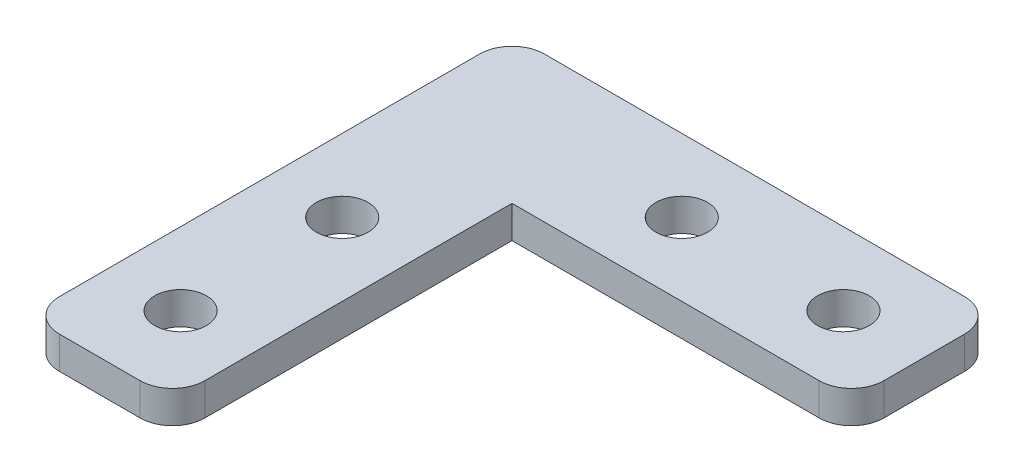
ISO-10303-21;
HEADER;
FILE_DESCRIPTION(('STEP AP214'),'2;1');
FILE_NAME('part.step','',(''),(''),'','','');
FILE_SCHEMA(('AUTOMOTIVE_DESIGN { 1 0 10303 214 1 1 1 1 }'));
ENDSEC;
DATA;
#1=APPLICATION_CONTEXT('core data for automotive mechanical design processes');
#2=APPLICATION_PROTOCOL_DEFINITION('international standard','automotive_design',2000,#1);
#3=PRODUCT_CONTEXT('',#1,'mechanical');
#4=PRODUCT('Part','Part','',(#3));
#5=PRODUCT_RELATED_PRODUCT_CATEGORY('part','',(#4));
#6=PRODUCT_DEFINITION_FORMATION('','',#4);
#7=PRODUCT_DEFINITION_CONTEXT('part definition',#1,'design');
#8=PRODUCT_DEFINITION('design','',#6,#7);
#9=PRODUCT_DEFINITION_SHAPE('','',#8);
#10=(LENGTH_UNIT() NAMED_UNIT(*) SI_UNIT(.MILLI.,.METRE.));
#11=(NAMED_UNIT(*) PLANE_ANGLE_UNIT() SI_UNIT($,.RADIAN.));
#12=(NAMED_UNIT(*) SI_UNIT($,.STERADIAN.) SOLID_ANGLE_UNIT());
#13=UNCERTAINTY_MEASURE_WITH_UNIT(LENGTH_MEASURE(1.E-05),#10,'distance_accuracy_value','');
#14=(GEOMETRIC_REPRESENTATION_CONTEXT(3) GLOBAL_UNCERTAINTY_ASSIGNED_CONTEXT((#13)) GLOBAL_UNIT_ASSIGNED_CONTEXT((#10,
#11,#12)) REPRESENTATION_CONTEXT('',''));
#15=CARTESIAN_POINT('',(0.,0.,0.));
#16=DIRECTION('',(0.,0.,1.));
#17=DIRECTION('',(1.,0.,0.));
#18=AXIS2_PLACEMENT_3D('',#15,#16,#17);
#19=CARTESIAN_POINT('',(0.,2.,0.));
#20=DIRECTION('',(0.,-1.,0.));
#21=DIRECTION('',(0.,0.,-1.));
#22=AXIS2_PLACEMENT_3D('',#19,#20,#21);
#23=PLANE('',#22);
#24=DIRECTION('',(-1.,0.,0.));
#25=VECTOR('',#24,1.);
#26=CARTESIAN_POINT('',(-15.,2.,-15.));
#27=LINE('',#26,#25);
#28=CARTESIAN_POINT('',(13.,2.,-15.));
#29=VERTEX_POINT('',#28);
#30=CARTESIAN_POINT('',(-13.,2.,-15.));
#31=VERTEX_POINT('',#30);
#32=EDGE_CURVE('E128',#29,#31,#27,.T.);
#33=ORIENTED_EDGE('',*,*,#32,.T.);
#34=CARTESIAN_POINT('',(-13.,2.,-13.));
#35=DIRECTION('',(0.,-1.,0.));
#36=DIRECTION('',(0.,0.,-1.));
#37=AXIS2_PLACEMENT_3D('',#34,#35,#36);
#38=CIRCLE('',#37,2.);
#39=CARTESIAN_POINT('',(-15.,2.,-13.));
#40=VERTEX_POINT('',#39);
#41=EDGE_CURVE('E175',#31,#40,#38,.F.);
#42=ORIENTED_EDGE('',*,*,#41,.T.);
#43=DIRECTION('',(0.,0.,1.));
#44=VECTOR('',#43,1.);
#45=CARTESIAN_POINT('',(-15.,2.,15.));
#46=LINE('',#45,#44);
#47=CARTESIAN_POINT('',(-15.,2.,13.));
#48=VERTEX_POINT('',#47);
#49=EDGE_CURVE('E121',#40,#48,#46,.T.);
#50=ORIENTED_EDGE('',*,*,#49,.T.);
#51=CARTESIAN_POINT('',(-13.,2.,13.));
#52=DIRECTION('',(0.,-1.,0.));
#53=DIRECTION('',(0.,0.,-1.));
#54=AXIS2_PLACEMENT_3D('',#51,#52,#53);
#55=CIRCLE('',#54,2.);
#56=CARTESIAN_POINT('',(-13.,2.,15.));
#57=VERTEX_POINT('',#56);
#58=EDGE_CURVE('E169',#48,#57,#55,.F.);
#59=ORIENTED_EDGE('',*,*,#58,.T.);
#60=DIRECTION('',(1.,0.,0.));
#61=VECTOR('',#60,1.);
#62=CARTESIAN_POINT('',(-6.,2.,15.));
#63=LINE('',#62,#61);
#64=CARTESIAN_POINT('',(-8.,2.,15.));
#65=VERTEX_POINT('',#64);
#66=EDGE_CURVE('E110',#57,#65,#63,.T.);
#67=ORIENTED_EDGE('',*,*,#66,.T.);
#68=CARTESIAN_POINT('',(-8.,2.,13.));
#69=DIRECTION('',(0.,-1.,0.));
#70=DIRECTION('',(0.,0.,-1.));
#71=AXIS2_PLACEMENT_3D('',#68,#69,#70);
#72=CIRCLE('',#71,2.);
#73=CARTESIAN_POINT('',(-6.,2.,13.));
#74=VERTEX_POINT('',#73);
#75=EDGE_CURVE('E106',#65,#74,#72,.F.);
#76=ORIENTED_EDGE('',*,*,#75,.T.);
#77=DIRECTION('',(0.,0.,-1.));
#78=VECTOR('',#77,1.);
#79=CARTESIAN_POINT('',(-6.,2.,-6.));
#80=LINE('',#79,#78);
#81=CARTESIAN_POINT('',(-6.,2.,-6.));
#82=VERTEX_POINT('',#81);
#83=EDGE_CURVE('E98',#74,#82,#80,.T.);
#84=ORIENTED_EDGE('',*,*,#83,.T.);
#85=DIRECTION('',(1.,0.,0.));
#86=VECTOR('',#85,1.);
#87=CARTESIAN_POINT('',(15.,2.,-6.));
#88=LINE('',#87,#86);
#89=CARTESIAN_POINT('',(13.,2.,-6.));
#90=VERTEX_POINT('',#89);
#91=EDGE_CURVE('E103',#82,#90,#88,.T.);
#92=ORIENTED_EDGE('',*,*,#91,.T.);
#93=CARTESIAN_POINT('',(13.,2.,-8.));
#94=DIRECTION('',(0.,-1.,0.));
#95=DIRECTION('',(0.,0.,-1.));
#96=AXIS2_PLACEMENT_3D('',#93,#94,#95);
#97=CIRCLE('',#96,2.);
#98=CARTESIAN_POINT('',(15.,2.,-8.));
#99=VERTEX_POINT('',#98);
#100=EDGE_CURVE('E38',#90,#99,#97,.F.);
#101=ORIENTED_EDGE('',*,*,#100,.T.);
#102=DIRECTION('',(0.,0.,-1.));
#103=VECTOR('',#102,1.);
#104=CARTESIAN_POINT('',(15.,2.,-15.));
#105=LINE('',#104,#103);
#106=CARTESIAN_POINT('',(15.,2.,-13.));
#107=VERTEX_POINT('',#106);
#108=EDGE_CURVE('E126',#99,#107,#105,.T.);
#109=ORIENTED_EDGE('',*,*,#108,.T.);
#110=CARTESIAN_POINT('',(13.,2.,-13.));
#111=DIRECTION('',(0.,-1.,0.));
#112=DIRECTION('',(0.,0.,-1.));
#113=AXIS2_PLACEMENT_3D('',#110,#111,#112);
#114=CIRCLE('',#113,2.);
#115=EDGE_CURVE('E173',#107,#29,#114,.F.);
#116=ORIENTED_EDGE('',*,*,#115,.T.);
#117=EDGE_LOOP('',(#33,#42,#50,#59,#67,#76,#84,#92,#101,#109,#116));
#118=FACE_BOUND('',#117,.T.);
#119=CARTESIAN_POINT('',(-10.5,2.,10.));
#120=DIRECTION('',(0.,1.,0.));
#121=DIRECTION('',(0.,0.,1.));
#122=AXIS2_PLACEMENT_3D('',#119,#120,#121);
#123=CIRCLE('',#122,1.6);
#124=CARTESIAN_POINT('',(-10.5,2.,11.6));
#125=VERTEX_POINT('',#124);
#126=EDGE_CURVE('E138',#125,#125,#123,.T.);
#127=ORIENTED_EDGE('',*,*,#126,.F.);
#128=EDGE_LOOP('',(#127));
#129=FACE_BOUND('',#128,.T.);
#130=CARTESIAN_POINT('',(0.,2.,-10.5));
#131=DIRECTION('',(0.,1.,0.));
#132=DIRECTION('',(0.,0.,1.));
#133=AXIS2_PLACEMENT_3D('',#130,#131,#132);
#134=CIRCLE('',#133,1.6);
#135=CARTESIAN_POINT('',(0.,2.,-8.9));
#136=VERTEX_POINT('',#135);
#137=EDGE_CURVE('E202',#136,#136,#134,.T.);
#138=ORIENTED_EDGE('',*,*,#137,.F.);
#139=EDGE_LOOP('',(#138));
#140=FACE_BOUND('',#139,.T.);
#141=CARTESIAN_POINT('',(-10.5,2.,0.));
#142=DIRECTION('',(0.,1.,0.));
#143=DIRECTION('',(0.,0.,1.));
#144=AXIS2_PLACEMENT_3D('',#141,#142,#143);
#145=CIRCLE('',#144,1.6);
#146=CARTESIAN_POINT('',(-10.5,2.,1.6));
#147=VERTEX_POINT('',#146);
#148=EDGE_CURVE('E208',#147,#147,#145,.T.);
#149=ORIENTED_EDGE('',*,*,#148,.F.);
#150=EDGE_LOOP('',(#149));
#151=FACE_BOUND('',#150,.T.);
#152=CARTESIAN_POINT('',(10.,2.,-10.5));
#153=DIRECTION('',(0.,1.,0.));
#154=DIRECTION('',(0.,0.,1.));
#155=AXIS2_PLACEMENT_3D('',#152,#153,#154);
#156=CIRCLE('',#155,1.6);
#157=CARTESIAN_POINT('',(10.,2.,-8.9));
#158=VERTEX_POINT('',#157);
#159=EDGE_CURVE('E214',#158,#158,#156,.T.);
#160=ORIENTED_EDGE('',*,*,#159,.F.);
#161=EDGE_LOOP('',(#160));
#162=FACE_BOUND('',#161,.T.);
#163=ADVANCED_FACE('F16',(#118,#129,#140,#151,#162),#23,.F.);
#164=CARTESIAN_POINT('',(0.,0.,0.));
#165=DIRECTION('',(0.,-1.,0.));
#166=DIRECTION('',(0.,0.,-1.));
#167=AXIS2_PLACEMENT_3D('',#164,#165,#166);
#168=PLANE('',#167);
#169=CARTESIAN_POINT('',(-10.5,0.,0.));
#170=DIRECTION('',(0.,1.,0.));
#171=DIRECTION('',(0.,0.,1.));
#172=AXIS2_PLACEMENT_3D('',#169,#170,#171);
#173=CIRCLE('',#172,1.6);
#174=CARTESIAN_POINT('',(-10.5,0.,1.6));
#175=VERTEX_POINT('',#174);
#176=EDGE_CURVE('E211',#175,#175,#173,.T.);
#177=ORIENTED_EDGE('',*,*,#176,.T.);
#178=EDGE_LOOP('',(#177));
#179=FACE_BOUND('',#178,.T.);
#180=CARTESIAN_POINT('',(-10.5,0.,10.));
#181=DIRECTION('',(0.,1.,0.));
#182=DIRECTION('',(0.,0.,1.));
#183=AXIS2_PLACEMENT_3D('',#180,#181,#182);
#184=CIRCLE('',#183,1.6);
#185=CARTESIAN_POINT('',(-10.5,0.,11.6));
#186=VERTEX_POINT('',#185);
#187=EDGE_CURVE('E199',#186,#186,#184,.T.);
#188=ORIENTED_EDGE('',*,*,#187,.T.);
#189=EDGE_LOOP('',(#188));
#190=FACE_BOUND('',#189,.T.);
#191=DIRECTION('',(0.,0.,1.));
#192=VECTOR('',#191,1.);
#193=CARTESIAN_POINT('',(-15.,0.,15.));
#194=LINE('',#193,#192);
#195=CARTESIAN_POINT('',(-15.,0.,-13.));
#196=VERTEX_POINT('',#195);
#197=CARTESIAN_POINT('',(-15.,0.,13.));
#198=VERTEX_POINT('',#197);
#199=EDGE_CURVE('E147',#196,#198,#194,.T.);
#200=ORIENTED_EDGE('',*,*,#199,.F.);
#201=CARTESIAN_POINT('',(-13.,0.,-13.));
#202=DIRECTION('',(0.,-1.,0.));
#203=DIRECTION('',(0.,0.,-1.));
#204=AXIS2_PLACEMENT_3D('',#201,#202,#203);
#205=CIRCLE('',#204,2.);
#206=CARTESIAN_POINT('',(-13.,0.,-15.));
#207=VERTEX_POINT('',#206);
#208=EDGE_CURVE('E162',#196,#207,#205,.T.);
#209=ORIENTED_EDGE('',*,*,#208,.T.);
#210=DIRECTION('',(-1.,0.,0.));
#211=VECTOR('',#210,1.);
#212=CARTESIAN_POINT('',(-15.,0.,-15.));
#213=LINE('',#212,#211);
#214=CARTESIAN_POINT('',(13.,0.,-15.));
#215=VERTEX_POINT('',#214);
#216=EDGE_CURVE('E144',#215,#207,#213,.T.);
#217=ORIENTED_EDGE('',*,*,#216,.F.);
#218=CARTESIAN_POINT('',(13.,0.,-13.));
#219=DIRECTION('',(0.,-1.,0.));
#220=DIRECTION('',(0.,0.,-1.));
#221=AXIS2_PLACEMENT_3D('',#218,#219,#220);
#222=CIRCLE('',#221,2.);
#223=CARTESIAN_POINT('',(15.,0.,-13.));
#224=VERTEX_POINT('',#223);
#225=EDGE_CURVE('E160',#215,#224,#222,.T.);
#226=ORIENTED_EDGE('',*,*,#225,.T.);
#227=DIRECTION('',(0.,0.,-1.));
#228=VECTOR('',#227,1.);
#229=CARTESIAN_POINT('',(15.,0.,-15.));
#230=LINE('',#229,#228);
#231=CARTESIAN_POINT('',(15.,0.,-8.));
#232=VERTEX_POINT('',#231);
#233=EDGE_CURVE('E142',#232,#224,#230,.T.);
#234=ORIENTED_EDGE('',*,*,#233,.F.);
#235=CARTESIAN_POINT('',(13.,0.,-8.));
#236=DIRECTION('',(0.,-1.,0.));
#237=DIRECTION('',(0.,0.,-1.));
#238=AXIS2_PLACEMENT_3D('',#235,#236,#237);
#239=CIRCLE('',#238,2.);
#240=CARTESIAN_POINT('',(13.,0.,-6.));
#241=VERTEX_POINT('',#240);
#242=EDGE_CURVE('E158',#232,#241,#239,.T.);
#243=ORIENTED_EDGE('',*,*,#242,.T.);
#244=DIRECTION('',(1.,0.,0.));
#245=VECTOR('',#244,1.);
#246=CARTESIAN_POINT('',(15.,0.,-6.));
#247=LINE('',#246,#245);
#248=CARTESIAN_POINT('',(-6.,0.,-6.));
#249=VERTEX_POINT('',#248);
#250=EDGE_CURVE('E140',#249,#241,#247,.T.);
#251=ORIENTED_EDGE('',*,*,#250,.F.);
#252=DIRECTION('',(0.,0.,-1.));
#253=VECTOR('',#252,1.);
#254=CARTESIAN_POINT('',(-6.,0.,-6.));
#255=LINE('',#254,#253);
#256=CARTESIAN_POINT('',(-6.,0.,13.));
#257=VERTEX_POINT('',#256);
#258=EDGE_CURVE('E116',#257,#249,#255,.T.);
#259=ORIENTED_EDGE('',*,*,#258,.F.);
#260=CARTESIAN_POINT('',(-8.,0.,13.));
#261=DIRECTION('',(0.,-1.,0.));
#262=DIRECTION('',(0.,0.,-1.));
#263=AXIS2_PLACEMENT_3D('',#260,#261,#262);
#264=CIRCLE('',#263,2.);
#265=CARTESIAN_POINT('',(-8.,0.,15.));
#266=VERTEX_POINT('',#265);
#267=EDGE_CURVE('E156',#257,#266,#264,.T.);
#268=ORIENTED_EDGE('',*,*,#267,.T.);
#269=DIRECTION('',(1.,0.,0.));
#270=VECTOR('',#269,1.);
#271=CARTESIAN_POINT('',(-6.,0.,15.));
#272=LINE('',#271,#270);
#273=CARTESIAN_POINT('',(-13.,0.,15.));
#274=VERTEX_POINT('',#273);
#275=EDGE_CURVE('E135',#274,#266,#272,.T.);
#276=ORIENTED_EDGE('',*,*,#275,.F.);
#277=CARTESIAN_POINT('',(-13.,0.,13.));
#278=DIRECTION('',(0.,-1.,0.));
#279=DIRECTION('',(0.,0.,-1.));
#280=AXIS2_PLACEMENT_3D('',#277,#278,#279);
#281=CIRCLE('',#280,2.);
#282=EDGE_CURVE('E154',#274,#198,#281,.T.);
#283=ORIENTED_EDGE('',*,*,#282,.T.);
#284=EDGE_LOOP('',(#200,#209,#217,#226,#234,#243,#251,#259,#268,#276,#283));
#285=FACE_BOUND('',#284,.T.);
#286=CARTESIAN_POINT('',(0.,0.,-10.5));
#287=DIRECTION('',(0.,1.,0.));
#288=DIRECTION('',(0.,0.,1.));
#289=AXIS2_PLACEMENT_3D('',#286,#287,#288);
#290=CIRCLE('',#289,1.6);
#291=CARTESIAN_POINT('',(0.,0.,-8.9));
#292=VERTEX_POINT('',#291);
#293=EDGE_CURVE('E205',#292,#292,#290,.T.);
#294=ORIENTED_EDGE('',*,*,#293,.T.);
#295=EDGE_LOOP('',(#294));
#296=FACE_BOUND('',#295,.T.);
#297=CARTESIAN_POINT('',(10.,0.,-10.5));
#298=DIRECTION('',(0.,1.,0.));
#299=DIRECTION('',(0.,0.,1.));
#300=AXIS2_PLACEMENT_3D('',#297,#298,#299);
#301=CIRCLE('',#300,1.6);
#302=CARTESIAN_POINT('',(10.,0.,-8.9));
#303=VERTEX_POINT('',#302);
#304=EDGE_CURVE('E217',#303,#303,#301,.T.);
#305=ORIENTED_EDGE('',*,*,#304,.T.);
#306=EDGE_LOOP('',(#305));
#307=FACE_BOUND('',#306,.T.);
#308=ADVANCED_FACE('F194',(#179,#190,#285,#296,#307),#168,.T.);
#309=CARTESIAN_POINT('',(-6.,2.,15.));
#310=DIRECTION('',(0.,0.,-1.));
#311=DIRECTION('',(-1.,0.,0.));
#312=AXIS2_PLACEMENT_3D('',#309,#310,#311);
#313=PLANE('',#312);
#314=ORIENTED_EDGE('',*,*,#275,.T.);
#315=DIRECTION('',(0.,-1.,0.));
#316=VECTOR('',#315,1.);
#317=CARTESIAN_POINT('',(-8.,2.,15.));
#318=LINE('',#317,#316);
#319=EDGE_CURVE('E10',#266,#65,#318,.F.);
#320=ORIENTED_EDGE('',*,*,#319,.T.);
#321=ORIENTED_EDGE('',*,*,#66,.F.);
#322=DIRECTION('',(0.,-1.,0.));
#323=VECTOR('',#322,1.);
#324=CARTESIAN_POINT('',(-13.,2.,15.));
#325=LINE('',#324,#323);
#326=EDGE_CURVE('E24',#57,#274,#325,.T.);
#327=ORIENTED_EDGE('',*,*,#326,.T.);
#328=EDGE_LOOP('',(#314,#320,#321,#327));
#329=FACE_BOUND('',#328,.T.);
#330=ADVANCED_FACE('F188',(#329),#313,.F.);
#331=CARTESIAN_POINT('',(-6.,2.,-6.));
#332=DIRECTION('',(-1.,0.,0.));
#333=DIRECTION('',(0.,0.,1.));
#334=AXIS2_PLACEMENT_3D('',#331,#332,#333);
#335=PLANE('',#334);
#336=ORIENTED_EDGE('',*,*,#83,.F.);
#337=DIRECTION('',(0.,-1.,0.));
#338=VECTOR('',#337,1.);
#339=CARTESIAN_POINT('',(-6.,2.,13.));
#340=LINE('',#339,#338);
#341=EDGE_CURVE('E182',#74,#257,#340,.T.);
#342=ORIENTED_EDGE('',*,*,#341,.T.);
#343=ORIENTED_EDGE('',*,*,#258,.T.);
#344=DIRECTION('',(0.,-1.,0.));
#345=VECTOR('',#344,1.);
#346=CARTESIAN_POINT('',(-6.,2.,-6.));
#347=LINE('',#346,#345);
#348=EDGE_CURVE('E113',#82,#249,#347,.T.);
#349=ORIENTED_EDGE('',*,*,#348,.F.);
#350=EDGE_LOOP('',(#336,#342,#343,#349));
#351=FACE_BOUND('',#350,.T.);
#352=ADVANCED_FACE('F114',(#351),#335,.F.);
#353=CARTESIAN_POINT('',(15.,2.,-6.));
#354=DIRECTION('',(0.,0.,-1.));
#355=DIRECTION('',(-1.,0.,0.));
#356=AXIS2_PLACEMENT_3D('',#353,#354,#355);
#357=PLANE('',#356);
#358=ORIENTED_EDGE('',*,*,#250,.T.);
#359=DIRECTION('',(0.,-1.,0.));
#360=VECTOR('',#359,1.);
#361=CARTESIAN_POINT('',(13.,2.,-6.));
#362=LINE('',#361,#360);
#363=EDGE_CURVE('E125',#241,#90,#362,.F.);
#364=ORIENTED_EDGE('',*,*,#363,.T.);
#365=ORIENTED_EDGE('',*,*,#91,.F.);
#366=ORIENTED_EDGE('',*,*,#348,.T.);
#367=EDGE_LOOP('',(#358,#364,#365,#366));
#368=FACE_BOUND('',#367,.T.);
#369=ADVANCED_FACE('F123',(#368),#357,.F.);
#370=CARTESIAN_POINT('',(15.,2.,-15.));
#371=DIRECTION('',(-1.,0.,0.));
#372=DIRECTION('',(0.,0.,1.));
#373=AXIS2_PLACEMENT_3D('',#370,#371,#372);
#374=PLANE('',#373);
#375=ORIENTED_EDGE('',*,*,#233,.T.);
#376=DIRECTION('',(0.,-1.,0.));
#377=VECTOR('',#376,1.);
#378=CARTESIAN_POINT('',(15.,2.,-13.));
#379=LINE('',#378,#377);
#380=EDGE_CURVE('E31',#224,#107,#379,.F.);
#381=ORIENTED_EDGE('',*,*,#380,.T.);
#382=ORIENTED_EDGE('',*,*,#108,.F.);
#383=DIRECTION('',(0.,-1.,0.));
#384=VECTOR('',#383,1.);
#385=CARTESIAN_POINT('',(15.,2.,-8.));
#386=LINE('',#385,#384);
#387=EDGE_CURVE('E177',#99,#232,#386,.T.);
#388=ORIENTED_EDGE('',*,*,#387,.T.);
#389=EDGE_LOOP('',(#375,#381,#382,#388));
#390=FACE_BOUND('',#389,.T.);
#391=ADVANCED_FACE('F245',(#390),#374,.F.);
#392=CARTESIAN_POINT('',(-15.,2.,-15.));
#393=DIRECTION('',(0.,0.,1.));
#394=DIRECTION('',(1.,0.,0.));
#395=AXIS2_PLACEMENT_3D('',#392,#393,#394);
#396=PLANE('',#395);
#397=ORIENTED_EDGE('',*,*,#216,.T.);
#398=DIRECTION('',(0.,-1.,0.));
#399=VECTOR('',#398,1.);
#400=CARTESIAN_POINT('',(-13.,2.,-15.));
#401=LINE('',#400,#399);
#402=EDGE_CURVE('E167',#207,#31,#401,.F.);
#403=ORIENTED_EDGE('',*,*,#402,.T.);
#404=ORIENTED_EDGE('',*,*,#32,.F.);
#405=DIRECTION('',(0.,-1.,0.));
#406=VECTOR('',#405,1.);
#407=CARTESIAN_POINT('',(13.,2.,-15.));
#408=LINE('',#407,#406);
#409=EDGE_CURVE('E164',#29,#215,#408,.T.);
#410=ORIENTED_EDGE('',*,*,#409,.T.);
#411=EDGE_LOOP('',(#397,#403,#404,#410));
#412=FACE_BOUND('',#411,.T.);
#413=ADVANCED_FACE('F241',(#412),#396,.F.);
#414=CARTESIAN_POINT('',(-15.,2.,15.));
#415=DIRECTION('',(1.,0.,0.));
#416=DIRECTION('',(0.,0.,-1.));
#417=AXIS2_PLACEMENT_3D('',#414,#415,#416);
#418=PLANE('',#417);
#419=ORIENTED_EDGE('',*,*,#49,.F.);
#420=DIRECTION('',(0.,-1.,0.));
#421=VECTOR('',#420,1.);
#422=CARTESIAN_POINT('',(-15.,2.,-13.));
#423=LINE('',#422,#421);
#424=EDGE_CURVE('E151',#40,#196,#423,.T.);
#425=ORIENTED_EDGE('',*,*,#424,.T.);
#426=ORIENTED_EDGE('',*,*,#199,.T.);
#427=DIRECTION('',(0.,-1.,0.));
#428=VECTOR('',#427,1.);
#429=CARTESIAN_POINT('',(-15.,2.,13.));
#430=LINE('',#429,#428);
#431=EDGE_CURVE('E120',#198,#48,#430,.F.);
#432=ORIENTED_EDGE('',*,*,#431,.T.);
#433=EDGE_LOOP('',(#419,#425,#426,#432));
#434=FACE_BOUND('',#433,.T.);
#435=ADVANCED_FACE('F238',(#434),#418,.F.);
#436=CARTESIAN_POINT('',(-10.5,2.,10.));
#437=DIRECTION('',(0.,-1.,0.));
#438=DIRECTION('',(0.,0.,-1.));
#439=AXIS2_PLACEMENT_3D('',#436,#437,#438);
#440=CYLINDRICAL_SURFACE('',#439,1.6);
#441=ORIENTED_EDGE('',*,*,#126,.T.);
#442=EDGE_LOOP('',(#441));
#443=FACE_BOUND('',#442,.T.);
#444=ORIENTED_EDGE('',*,*,#187,.F.);
#445=EDGE_LOOP('',(#444));
#446=FACE_BOUND('',#445,.T.);
#447=ADVANCED_FACE('F235',(#443,#446),#440,.F.);
#448=CARTESIAN_POINT('',(0.,2.,-10.5));
#449=DIRECTION('',(0.,-1.,0.));
#450=DIRECTION('',(0.,0.,-1.));
#451=AXIS2_PLACEMENT_3D('',#448,#449,#450);
#452=CYLINDRICAL_SURFACE('',#451,1.6);
#453=ORIENTED_EDGE('',*,*,#137,.T.);
#454=EDGE_LOOP('',(#453));
#455=FACE_BOUND('',#454,.T.);
#456=ORIENTED_EDGE('',*,*,#293,.F.);
#457=EDGE_LOOP('',(#456));
#458=FACE_BOUND('',#457,.T.);
#459=ADVANCED_FACE('F333',(#455,#458),#452,.F.);
#460=CARTESIAN_POINT('',(-10.5,2.,0.));
#461=DIRECTION('',(0.,-1.,0.));
#462=DIRECTION('',(0.,0.,-1.));
#463=AXIS2_PLACEMENT_3D('',#460,#461,#462);
#464=CYLINDRICAL_SURFACE('',#463,1.6);
#465=ORIENTED_EDGE('',*,*,#148,.T.);
#466=EDGE_LOOP('',(#465));
#467=FACE_BOUND('',#466,.T.);
#468=ORIENTED_EDGE('',*,*,#176,.F.);
#469=EDGE_LOOP('',(#468));
#470=FACE_BOUND('',#469,.T.);
#471=ADVANCED_FACE('F322',(#467,#470),#464,.F.);
#472=CARTESIAN_POINT('',(10.,2.,-10.5));
#473=DIRECTION('',(0.,-1.,0.));
#474=DIRECTION('',(0.,0.,-1.));
#475=AXIS2_PLACEMENT_3D('',#472,#473,#474);
#476=CYLINDRICAL_SURFACE('',#475,1.6);
#477=ORIENTED_EDGE('',*,*,#159,.T.);
#478=EDGE_LOOP('',(#477));
#479=FACE_BOUND('',#478,.T.);
#480=ORIENTED_EDGE('',*,*,#304,.F.);
#481=EDGE_LOOP('',(#480));
#482=FACE_BOUND('',#481,.T.);
#483=ADVANCED_FACE('F223',(#479,#482),#476,.F.);
#484=CARTESIAN_POINT('',(-13.,2.,-13.));
#485=DIRECTION('',(0.,-1.,0.));
#486=DIRECTION('',(0.,0.,-1.));
#487=AXIS2_PLACEMENT_3D('',#484,#485,#486);
#488=CYLINDRICAL_SURFACE('',#487,2.);
#489=ORIENTED_EDGE('',*,*,#41,.F.);
#490=ORIENTED_EDGE('',*,*,#402,.F.);
#491=ORIENTED_EDGE('',*,*,#208,.F.);
#492=ORIENTED_EDGE('',*,*,#424,.F.);
#493=EDGE_LOOP('',(#489,#490,#491,#492));
#494=FACE_BOUND('',#493,.T.);
#495=ADVANCED_FACE('F255',(#494),#488,.T.);
#496=CARTESIAN_POINT('',(13.,2.,-13.));
#497=DIRECTION('',(0.,-1.,0.));
#498=DIRECTION('',(0.,0.,-1.));
#499=AXIS2_PLACEMENT_3D('',#496,#497,#498);
#500=CYLINDRICAL_SURFACE('',#499,2.);
#501=ORIENTED_EDGE('',*,*,#115,.F.);
#502=ORIENTED_EDGE('',*,*,#380,.F.);
#503=ORIENTED_EDGE('',*,*,#225,.F.);
#504=ORIENTED_EDGE('',*,*,#409,.F.);
#505=EDGE_LOOP('',(#501,#502,#503,#504));
#506=FACE_BOUND('',#505,.T.);
#507=ADVANCED_FACE('F258',(#506),#500,.T.);
#508=CARTESIAN_POINT('',(13.,2.,-8.));
#509=DIRECTION('',(0.,-1.,0.));
#510=DIRECTION('',(0.,0.,-1.));
#511=AXIS2_PLACEMENT_3D('',#508,#509,#510);
#512=CYLINDRICAL_SURFACE('',#511,2.);
#513=ORIENTED_EDGE('',*,*,#100,.F.);
#514=ORIENTED_EDGE('',*,*,#363,.F.);
#515=ORIENTED_EDGE('',*,*,#242,.F.);
#516=ORIENTED_EDGE('',*,*,#387,.F.);
#517=EDGE_LOOP('',(#513,#514,#515,#516));
#518=FACE_BOUND('',#517,.T.);
#519=ADVANCED_FACE('F262',(#518),#512,.T.);
#520=CARTESIAN_POINT('',(-8.,2.,13.));
#521=DIRECTION('',(0.,-1.,0.));
#522=DIRECTION('',(0.,0.,-1.));
#523=AXIS2_PLACEMENT_3D('',#520,#521,#522);
#524=CYLINDRICAL_SURFACE('',#523,2.);
#525=ORIENTED_EDGE('',*,*,#75,.F.);
#526=ORIENTED_EDGE('',*,*,#319,.F.);
#527=ORIENTED_EDGE('',*,*,#267,.F.);
#528=ORIENTED_EDGE('',*,*,#341,.F.);
#529=EDGE_LOOP('',(#525,#526,#527,#528));
#530=FACE_BOUND('',#529,.T.);
#531=ADVANCED_FACE('F197',(#530),#524,.T.);
#532=CARTESIAN_POINT('',(-13.,2.,13.));
#533=DIRECTION('',(0.,-1.,0.));
#534=DIRECTION('',(0.,0.,-1.));
#535=AXIS2_PLACEMENT_3D('',#532,#533,#534);
#536=CYLINDRICAL_SURFACE('',#535,2.);
#537=ORIENTED_EDGE('',*,*,#58,.F.);
#538=ORIENTED_EDGE('',*,*,#431,.F.);
#539=ORIENTED_EDGE('',*,*,#282,.F.);
#540=ORIENTED_EDGE('',*,*,#326,.F.);
#541=EDGE_LOOP('',(#537,#538,#539,#540));
#542=FACE_BOUND('',#541,.T.);
#543=ADVANCED_FACE('F18',(#542),#536,.T.);
#544=CLOSED_SHELL('',(#163,#308,#330,#352,#369,#391,#413,#435,#447,#459,#471,#483,#495,#507,
#519,#531,#543));
#545=MANIFOLD_SOLID_BREP('B1',#544);
#546=ADVANCED_BREP_SHAPE_REPRESENTATION('',(#18,#545),#14);
#547=SHAPE_DEFINITION_REPRESENTATION(#9,#546);
ENDSEC;
END-ISO-10303-21;
